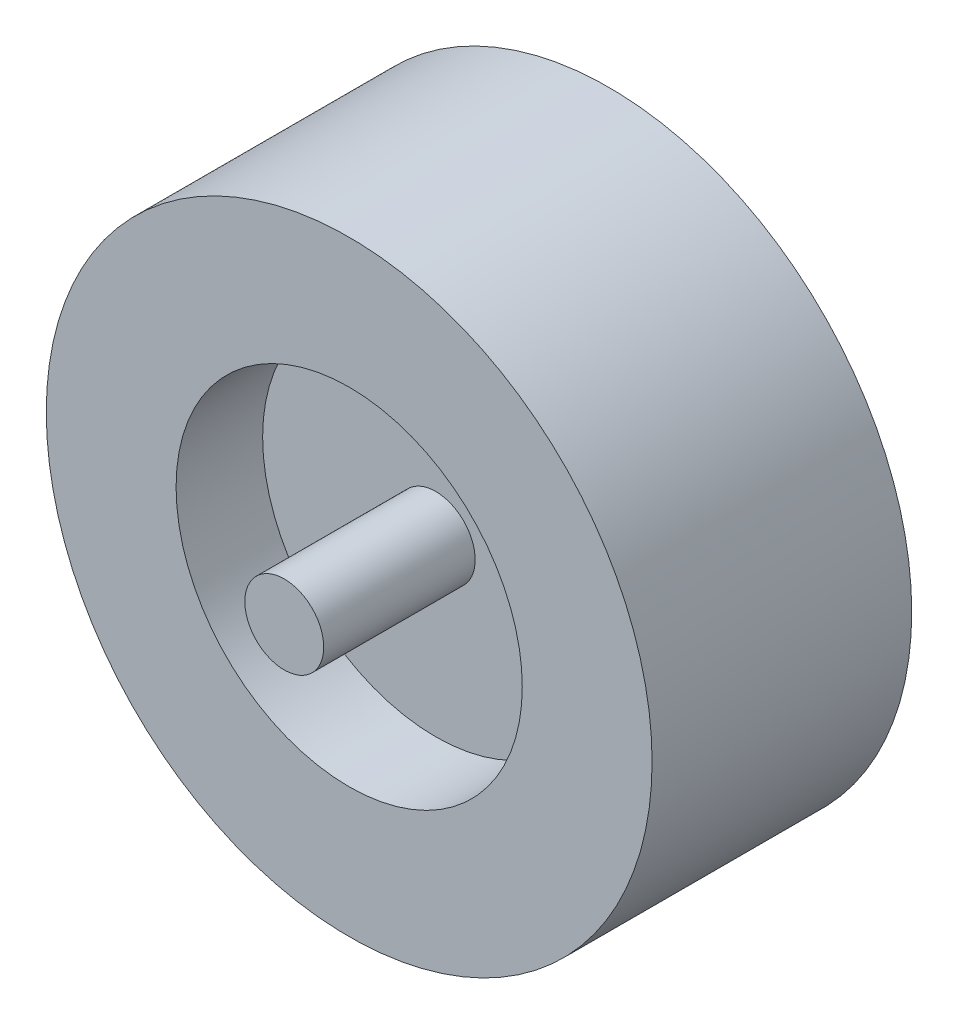
ISO-10303-21;
HEADER;
FILE_DESCRIPTION(('STEP AP214'),'2;1');
FILE_NAME('part.step','',(''),(''),'','','');
FILE_SCHEMA(('AUTOMOTIVE_DESIGN { 1 0 10303 214 1 1 1 1 }'));
ENDSEC;
DATA;
#1=APPLICATION_CONTEXT('core data for automotive mechanical design processes');
#2=APPLICATION_PROTOCOL_DEFINITION('international standard','automotive_design',2000,#1);
#3=PRODUCT_CONTEXT('',#1,'mechanical');
#4=PRODUCT('Part','Part','',(#3));
#5=PRODUCT_RELATED_PRODUCT_CATEGORY('part','',(#4));
#6=PRODUCT_DEFINITION_FORMATION('','',#4);
#7=PRODUCT_DEFINITION_CONTEXT('part definition',#1,'design');
#8=PRODUCT_DEFINITION('design','',#6,#7);
#9=PRODUCT_DEFINITION_SHAPE('','',#8);
#10=(LENGTH_UNIT() NAMED_UNIT(*) SI_UNIT(.MILLI.,.METRE.));
#11=(NAMED_UNIT(*) PLANE_ANGLE_UNIT() SI_UNIT($,.RADIAN.));
#12=(NAMED_UNIT(*) SI_UNIT($,.STERADIAN.) SOLID_ANGLE_UNIT());
#13=UNCERTAINTY_MEASURE_WITH_UNIT(LENGTH_MEASURE(1.E-05),#10,'distance_accuracy_value','');
#14=(GEOMETRIC_REPRESENTATION_CONTEXT(3) GLOBAL_UNCERTAINTY_ASSIGNED_CONTEXT((#13)) GLOBAL_UNIT_ASSIGNED_CONTEXT((#10,
#11,#12)) REPRESENTATION_CONTEXT('',''));
#15=CARTESIAN_POINT('',(0.,0.,0.));
#16=DIRECTION('',(0.,0.,1.));
#17=DIRECTION('',(1.,0.,0.));
#18=AXIS2_PLACEMENT_3D('',#15,#16,#17);
#19=CARTESIAN_POINT('',(0.,0.,-19.05));
#20=DIRECTION('',(0.,0.,1.));
#21=DIRECTION('',(1.,0.,0.));
#22=AXIS2_PLACEMENT_3D('',#19,#20,#21);
#23=PLANE('',#22);
#24=CARTESIAN_POINT('',(0.,0.,-19.05));
#25=DIRECTION('',(0.,0.,1.));
#26=DIRECTION('',(1.,0.,0.));
#27=AXIS2_PLACEMENT_3D('',#24,#25,#26);
#28=CIRCLE('',#27,17.36725);
#29=CARTESIAN_POINT('',(17.36725,0.,-19.05));
#30=VERTEX_POINT('',#29);
#31=EDGE_CURVE('E10',#30,#30,#28,.F.);
#32=ORIENTED_EDGE('',*,*,#31,.F.);
#33=EDGE_LOOP('',(#32));
#34=FACE_BOUND('',#33,.T.);
#35=CARTESIAN_POINT('',(0.,0.,-19.05));
#36=DIRECTION('',(0.,0.,1.));
#37=DIRECTION('',(1.,0.,0.));
#38=AXIS2_PLACEMENT_3D('',#35,#36,#37);
#39=CIRCLE('',#38,76.2);
#40=CARTESIAN_POINT('',(76.2,0.,-19.05));
#41=VERTEX_POINT('',#40);
#42=EDGE_CURVE('E52',#41,#41,#39,.T.);
#43=ORIENTED_EDGE('',*,*,#42,.F.);
#44=EDGE_LOOP('',(#43));
#45=FACE_BOUND('',#44,.T.);
#46=ADVANCED_FACE('F36',(#34,#45),#23,.F.);
#47=CARTESIAN_POINT('',(0.,0.,19.05));
#48=DIRECTION('',(0.,0.,-1.));
#49=DIRECTION('',(-1.,0.,0.));
#50=AXIS2_PLACEMENT_3D('',#47,#48,#49);
#51=PLANE('',#50);
#52=CARTESIAN_POINT('',(0.,0.,19.05));
#53=DIRECTION('',(0.,0.,-1.));
#54=DIRECTION('',(-1.,0.,0.));
#55=AXIS2_PLACEMENT_3D('',#52,#53,#54);
#56=CIRCLE('',#55,17.36725);
#57=CARTESIAN_POINT('',(-17.36725,0.,19.05));
#58=VERTEX_POINT('',#57);
#59=EDGE_CURVE('E39',#58,#58,#56,.F.);
#60=ORIENTED_EDGE('',*,*,#59,.F.);
#61=EDGE_LOOP('',(#60));
#62=FACE_BOUND('',#61,.T.);
#63=CARTESIAN_POINT('',(0.,0.,19.05));
#64=DIRECTION('',(0.,0.,1.));
#65=DIRECTION('',(1.,0.,0.));
#66=AXIS2_PLACEMENT_3D('',#63,#64,#65);
#67=CIRCLE('',#66,76.2);
#68=CARTESIAN_POINT('',(76.2,0.,19.05));
#69=VERTEX_POINT('',#68);
#70=EDGE_CURVE('E47',#69,#69,#67,.T.);
#71=ORIENTED_EDGE('',*,*,#70,.T.);
#72=EDGE_LOOP('',(#71));
#73=FACE_BOUND('',#72,.T.);
#74=ADVANCED_FACE('F70',(#62,#73),#51,.F.);
#75=CARTESIAN_POINT('',(0.,0.,19.05));
#76=DIRECTION('',(0.,0.,1.));
#77=DIRECTION('',(1.,0.,0.));
#78=AXIS2_PLACEMENT_3D('',#75,#76,#77);
#79=CYLINDRICAL_SURFACE('',#78,76.2);
#80=ORIENTED_EDGE('',*,*,#70,.F.);
#81=EDGE_LOOP('',(#80));
#82=FACE_BOUND('',#81,.T.);
#83=CARTESIAN_POINT('',(0.,0.,57.15));
#84=DIRECTION('',(0.,0.,1.));
#85=DIRECTION('',(1.,0.,0.));
#86=AXIS2_PLACEMENT_3D('',#83,#84,#85);
#87=CIRCLE('',#86,76.2);
#88=CARTESIAN_POINT('',(76.2,0.,57.15));
#89=VERTEX_POINT('',#88);
#90=EDGE_CURVE('E65',#89,#89,#87,.T.);
#91=ORIENTED_EDGE('',*,*,#90,.T.);
#92=EDGE_LOOP('',(#91));
#93=FACE_BOUND('',#92,.T.);
#94=ADVANCED_FACE('F72',(#82,#93),#79,.F.);
#95=CARTESIAN_POINT('',(0.,76.2,57.15));
#96=DIRECTION('',(0.,0.,-1.));
#97=DIRECTION('',(-1.,0.,0.));
#98=AXIS2_PLACEMENT_3D('',#95,#96,#97);
#99=PLANE('',#98);
#100=ORIENTED_EDGE('',*,*,#90,.F.);
#101=EDGE_LOOP('',(#100));
#102=FACE_BOUND('',#101,.T.);
#103=CARTESIAN_POINT('',(0.,0.,57.15));
#104=DIRECTION('',(0.,0.,1.));
#105=DIRECTION('',(1.,0.,0.));
#106=AXIS2_PLACEMENT_3D('',#103,#104,#105);
#107=CIRCLE('',#106,133.35);
#108=CARTESIAN_POINT('',(133.35,0.,57.15));
#109=VERTEX_POINT('',#108);
#110=EDGE_CURVE('E62',#109,#109,#107,.T.);
#111=ORIENTED_EDGE('',*,*,#110,.T.);
#112=EDGE_LOOP('',(#111));
#113=FACE_BOUND('',#112,.T.);
#114=ADVANCED_FACE('F75',(#102,#113),#99,.F.);
#115=CARTESIAN_POINT('',(0.,0.,19.05));
#116=DIRECTION('',(0.,0.,1.));
#117=DIRECTION('',(1.,0.,0.));
#118=AXIS2_PLACEMENT_3D('',#115,#116,#117);
#119=CYLINDRICAL_SURFACE('',#118,133.35);
#120=ORIENTED_EDGE('',*,*,#110,.F.);
#121=EDGE_LOOP('',(#120));
#122=FACE_BOUND('',#121,.T.);
#123=CARTESIAN_POINT('',(0.,0.,-57.15));
#124=DIRECTION('',(0.,0.,1.));
#125=DIRECTION('',(1.,0.,0.));
#126=AXIS2_PLACEMENT_3D('',#123,#124,#125);
#127=CIRCLE('',#126,133.35);
#128=CARTESIAN_POINT('',(133.35,0.,-57.15));
#129=VERTEX_POINT('',#128);
#130=EDGE_CURVE('E59',#129,#129,#127,.T.);
#131=ORIENTED_EDGE('',*,*,#130,.T.);
#132=EDGE_LOOP('',(#131));
#133=FACE_BOUND('',#132,.T.);
#134=ADVANCED_FACE('F81',(#122,#133),#119,.T.);
#135=CARTESIAN_POINT('',(0.,76.2,-57.15));
#136=DIRECTION('',(0.,0.,1.));
#137=DIRECTION('',(1.,0.,0.));
#138=AXIS2_PLACEMENT_3D('',#135,#136,#137);
#139=PLANE('',#138);
#140=ORIENTED_EDGE('',*,*,#130,.F.);
#141=EDGE_LOOP('',(#140));
#142=FACE_BOUND('',#141,.T.);
#143=CARTESIAN_POINT('',(0.,0.,-57.15));
#144=DIRECTION('',(0.,0.,1.));
#145=DIRECTION('',(1.,0.,0.));
#146=AXIS2_PLACEMENT_3D('',#143,#144,#145);
#147=CIRCLE('',#146,76.2);
#148=CARTESIAN_POINT('',(76.2,0.,-57.15));
#149=VERTEX_POINT('',#148);
#150=EDGE_CURVE('E55',#149,#149,#147,.T.);
#151=ORIENTED_EDGE('',*,*,#150,.T.);
#152=EDGE_LOOP('',(#151));
#153=FACE_BOUND('',#152,.T.);
#154=ADVANCED_FACE('F87',(#142,#153),#139,.F.);
#155=CARTESIAN_POINT('',(0.,0.,19.05));
#156=DIRECTION('',(0.,0.,1.));
#157=DIRECTION('',(1.,0.,0.));
#158=AXIS2_PLACEMENT_3D('',#155,#156,#157);
#159=CYLINDRICAL_SURFACE('',#158,76.2);
#160=ORIENTED_EDGE('',*,*,#150,.F.);
#161=EDGE_LOOP('',(#160));
#162=FACE_BOUND('',#161,.T.);
#163=ORIENTED_EDGE('',*,*,#42,.T.);
#164=EDGE_LOOP('',(#163));
#165=FACE_BOUND('',#164,.T.);
#166=ADVANCED_FACE('F93',(#162,#165),#159,.F.);
#167=CARTESIAN_POINT('',(0.,0.,85.725));
#168=DIRECTION('',(0.,0.,-1.));
#169=DIRECTION('',(-1.,0.,0.));
#170=AXIS2_PLACEMENT_3D('',#167,#168,#169);
#171=PLANE('',#170);
#172=CARTESIAN_POINT('',(0.,0.,85.725));
#173=DIRECTION('',(0.,0.,-1.));
#174=DIRECTION('',(-1.,0.,0.));
#175=AXIS2_PLACEMENT_3D('',#172,#173,#174);
#176=CIRCLE('',#175,17.36725);
#177=CARTESIAN_POINT('',(-17.36725,0.,85.725));
#178=VERTEX_POINT('',#177);
#179=EDGE_CURVE('E50',#178,#178,#176,.T.);
#180=ORIENTED_EDGE('',*,*,#179,.F.);
#181=EDGE_LOOP('',(#180));
#182=FACE_BOUND('',#181,.T.);
#183=ADVANCED_FACE('F99',(#182),#171,.F.);
#184=CARTESIAN_POINT('',(0.,0.,-85.725));
#185=DIRECTION('',(0.,0.,1.));
#186=DIRECTION('',(1.,0.,0.));
#187=AXIS2_PLACEMENT_3D('',#184,#185,#186);
#188=CYLINDRICAL_SURFACE('',#187,17.36725);
#189=ORIENTED_EDGE('',*,*,#179,.T.);
#190=EDGE_LOOP('',(#189));
#191=FACE_BOUND('',#190,.T.);
#192=ORIENTED_EDGE('',*,*,#59,.T.);
#193=EDGE_LOOP('',(#192));
#194=FACE_BOUND('',#193,.T.);
#195=ADVANCED_FACE('F117',(#191,#194),#188,.T.);
#196=CARTESIAN_POINT('',(0.,0.,-85.725));
#197=DIRECTION('',(0.,0.,-1.));
#198=DIRECTION('',(-1.,0.,0.));
#199=AXIS2_PLACEMENT_3D('',#196,#197,#198);
#200=CIRCLE('',#199,17.36725);
#201=CARTESIAN_POINT('',(-17.36725,0.,-85.725));
#202=VERTEX_POINT('',#201);
#203=EDGE_CURVE('E56',#202,#202,#200,.T.);
#204=ORIENTED_EDGE('',*,*,#203,.F.);
#205=EDGE_LOOP('',(#204));
#206=FACE_BOUND('',#205,.T.);
#207=ORIENTED_EDGE('',*,*,#31,.T.);
#208=EDGE_LOOP('',(#207));
#209=FACE_BOUND('',#208,.T.);
#210=ADVANCED_FACE('F113',(#206,#209),#188,.T.);
#211=CARTESIAN_POINT('',(0.,0.,-85.725));
#212=DIRECTION('',(0.,0.,-1.));
#213=DIRECTION('',(-1.,0.,0.));
#214=AXIS2_PLACEMENT_3D('',#211,#212,#213);
#215=PLANE('',#214);
#216=ORIENTED_EDGE('',*,*,#203,.T.);
#217=EDGE_LOOP('',(#216));
#218=FACE_BOUND('',#217,.T.);
#219=ADVANCED_FACE('F116',(#218),#215,.T.);
#220=CLOSED_SHELL('',(#46,#74,#94,#114,#134,#154,#166,#183,#195,#210,#219));
#221=MANIFOLD_SOLID_BREP('B2',#220);
#222=ADVANCED_BREP_SHAPE_REPRESENTATION('',(#18,#221),#14);
#223=SHAPE_DEFINITION_REPRESENTATION(#9,#222);
ENDSEC;
END-ISO-10303-21;
